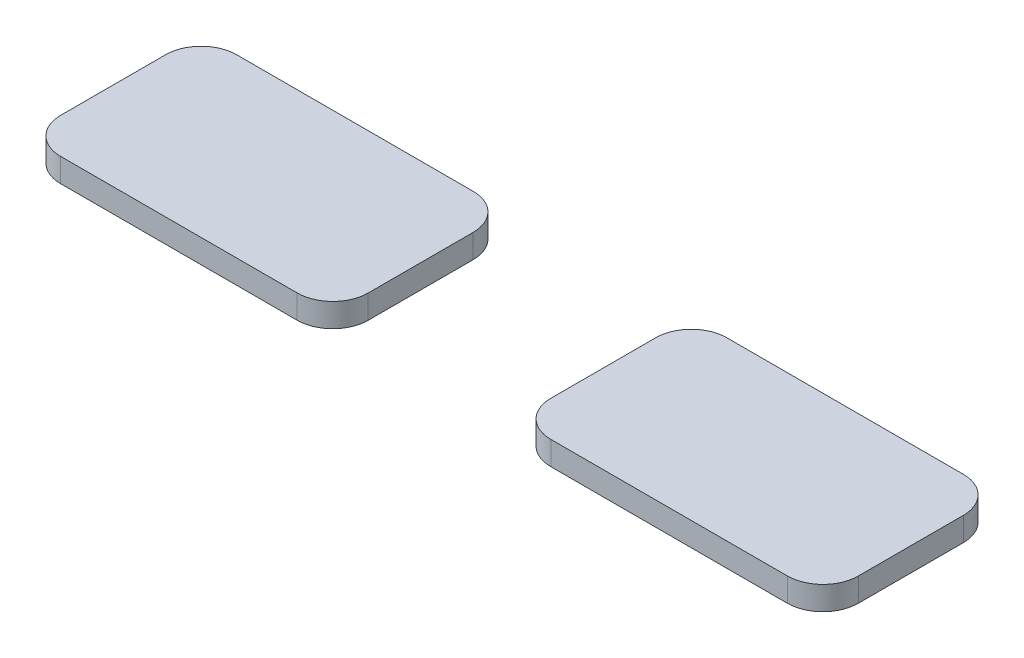
ISO-10303-21;
HEADER;
FILE_DESCRIPTION(('STEP AP214'),'2;1');
FILE_NAME('part.step','',(''),(''),'','','');
FILE_SCHEMA(('AUTOMOTIVE_DESIGN { 1 0 10303 214 1 1 1 1 }'));
ENDSEC;
DATA;
#1=APPLICATION_CONTEXT('core data for automotive mechanical design processes');
#2=APPLICATION_PROTOCOL_DEFINITION('international standard','automotive_design',2000,#1);
#3=PRODUCT_CONTEXT('',#1,'mechanical');
#4=PRODUCT('Part','Part','',(#3));
#5=PRODUCT_RELATED_PRODUCT_CATEGORY('part','',(#4));
#6=PRODUCT_DEFINITION_FORMATION('','',#4);
#7=PRODUCT_DEFINITION_CONTEXT('part definition',#1,'design');
#8=PRODUCT_DEFINITION('design','',#6,#7);
#9=PRODUCT_DEFINITION_SHAPE('','',#8);
#10=(LENGTH_UNIT() NAMED_UNIT(*) SI_UNIT(.MILLI.,.METRE.));
#11=(NAMED_UNIT(*) PLANE_ANGLE_UNIT() SI_UNIT($,.RADIAN.));
#12=(NAMED_UNIT(*) SI_UNIT($,.STERADIAN.) SOLID_ANGLE_UNIT());
#13=UNCERTAINTY_MEASURE_WITH_UNIT(LENGTH_MEASURE(1.E-05),#10,'distance_accuracy_value','');
#14=(GEOMETRIC_REPRESENTATION_CONTEXT(3) GLOBAL_UNCERTAINTY_ASSIGNED_CONTEXT((#13)) GLOBAL_UNIT_ASSIGNED_CONTEXT((#10,
#11,#12)) REPRESENTATION_CONTEXT('',''));
#15=CARTESIAN_POINT('',(0.,0.,0.));
#16=DIRECTION('',(0.,0.,1.));
#17=DIRECTION('',(1.,0.,0.));
#18=AXIS2_PLACEMENT_3D('',#15,#16,#17);
#19=CARTESIAN_POINT('',(31.4146552937155,2.,-4.435));
#20=DIRECTION('',(0.,-1.,0.));
#21=DIRECTION('',(0.,0.,-1.));
#22=AXIS2_PLACEMENT_3D('',#19,#20,#21);
#23=CYLINDRICAL_SURFACE('',#22,3.);
#24=CARTESIAN_POINT('',(31.4146552937155,0.,-4.435));
#25=DIRECTION('',(0.,1.,0.));
#26=DIRECTION('',(0.,0.,1.));
#27=AXIS2_PLACEMENT_3D('',#24,#25,#26);
#28=CIRCLE('',#27,3.);
#29=CARTESIAN_POINT('',(31.4146552937156,0.,-7.435));
#30=VERTEX_POINT('',#29);
#31=CARTESIAN_POINT('',(28.4146552937155,0.,-4.43499999999998));
#32=VERTEX_POINT('',#31);
#33=EDGE_CURVE('E12',#30,#32,#28,.T.);
#34=ORIENTED_EDGE('',*,*,#33,.T.);
#35=DIRECTION('',(0.,-1.,0.));
#36=VECTOR('',#35,1.);
#37=CARTESIAN_POINT('',(28.4146552937155,2.,-4.43499999999998));
#38=LINE('',#37,#36);
#39=CARTESIAN_POINT('',(28.4146552937155,2.,-4.43499999999998));
#40=VERTEX_POINT('',#39);
#41=EDGE_CURVE('E187',#40,#32,#38,.T.);
#42=ORIENTED_EDGE('',*,*,#41,.F.);
#43=CARTESIAN_POINT('',(31.4146552937155,2.,-4.435));
#44=DIRECTION('',(0.,1.,0.));
#45=DIRECTION('',(0.,0.,1.));
#46=AXIS2_PLACEMENT_3D('',#43,#44,#45);
#47=CIRCLE('',#46,3.);
#48=CARTESIAN_POINT('',(31.4146552937156,2.,-7.435));
#49=VERTEX_POINT('',#48);
#50=EDGE_CURVE('E55',#49,#40,#47,.T.);
#51=ORIENTED_EDGE('',*,*,#50,.F.);
#52=DIRECTION('',(0.,-1.,0.));
#53=VECTOR('',#52,1.);
#54=CARTESIAN_POINT('',(31.4146552937156,2.,-7.435));
#55=LINE('',#54,#53);
#56=EDGE_CURVE('E155',#49,#30,#55,.T.);
#57=ORIENTED_EDGE('',*,*,#56,.T.);
#58=EDGE_LOOP('',(#34,#42,#51,#57));
#59=FACE_BOUND('',#58,.T.);
#60=ADVANCED_FACE('F51',(#59),#23,.T.);
#61=CARTESIAN_POINT('',(28.4146552937155,2.,4.43499999999998));
#62=DIRECTION('',(1.,0.,0.));
#63=DIRECTION('',(0.,0.,-1.));
#64=AXIS2_PLACEMENT_3D('',#61,#62,#63);
#65=PLANE('',#64);
#66=DIRECTION('',(0.,0.,1.));
#67=VECTOR('',#66,1.);
#68=CARTESIAN_POINT('',(28.4146552937155,0.,4.43499999999998));
#69=LINE('',#68,#67);
#70=CARTESIAN_POINT('',(28.4146552937155,0.,4.43499999999998));
#71=VERTEX_POINT('',#70);
#72=EDGE_CURVE('E61',#32,#71,#69,.T.);
#73=ORIENTED_EDGE('',*,*,#72,.T.);
#74=DIRECTION('',(0.,-1.,0.));
#75=VECTOR('',#74,1.);
#76=CARTESIAN_POINT('',(28.4146552937155,2.,4.43499999999998));
#77=LINE('',#76,#75);
#78=CARTESIAN_POINT('',(28.4146552937155,2.,4.43499999999998));
#79=VERTEX_POINT('',#78);
#80=EDGE_CURVE('E131',#79,#71,#77,.T.);
#81=ORIENTED_EDGE('',*,*,#80,.F.);
#82=DIRECTION('',(0.,0.,1.));
#83=VECTOR('',#82,1.);
#84=CARTESIAN_POINT('',(28.4146552937155,2.,4.43499999999998));
#85=LINE('',#84,#83);
#86=EDGE_CURVE('E97',#40,#79,#85,.T.);
#87=ORIENTED_EDGE('',*,*,#86,.F.);
#88=ORIENTED_EDGE('',*,*,#41,.T.);
#89=EDGE_LOOP('',(#73,#81,#87,#88));
#90=FACE_BOUND('',#89,.T.);
#91=ADVANCED_FACE('F193',(#90),#65,.F.);
#92=CARTESIAN_POINT('',(31.4146552937155,2.,4.435));
#93=DIRECTION('',(0.,-1.,0.));
#94=DIRECTION('',(0.,0.,-1.));
#95=AXIS2_PLACEMENT_3D('',#92,#93,#94);
#96=CYLINDRICAL_SURFACE('',#95,3.);
#97=CARTESIAN_POINT('',(31.4146552937155,0.,4.435));
#98=DIRECTION('',(0.,1.,0.));
#99=DIRECTION('',(0.,0.,-1.));
#100=AXIS2_PLACEMENT_3D('',#97,#98,#99);
#101=CIRCLE('',#100,3.);
#102=CARTESIAN_POINT('',(31.4146552937156,0.,7.435));
#103=VERTEX_POINT('',#102);
#104=EDGE_CURVE('E125',#71,#103,#101,.T.);
#105=ORIENTED_EDGE('',*,*,#104,.T.);
#106=DIRECTION('',(0.,-1.,0.));
#107=VECTOR('',#106,1.);
#108=CARTESIAN_POINT('',(31.4146552937156,2.,7.435));
#109=LINE('',#108,#107);
#110=CARTESIAN_POINT('',(31.4146552937156,2.,7.435));
#111=VERTEX_POINT('',#110);
#112=EDGE_CURVE('E129',#111,#103,#109,.T.);
#113=ORIENTED_EDGE('',*,*,#112,.F.);
#114=CARTESIAN_POINT('',(31.4146552937155,2.,4.435));
#115=DIRECTION('',(0.,1.,0.));
#116=DIRECTION('',(0.,0.,-1.));
#117=AXIS2_PLACEMENT_3D('',#114,#115,#116);
#118=CIRCLE('',#117,3.);
#119=EDGE_CURVE('E162',#79,#111,#118,.T.);
#120=ORIENTED_EDGE('',*,*,#119,.F.);
#121=ORIENTED_EDGE('',*,*,#80,.T.);
#122=EDGE_LOOP('',(#105,#113,#120,#121));
#123=FACE_BOUND('',#122,.T.);
#124=ADVANCED_FACE('F127',(#123),#96,.T.);
#125=CARTESIAN_POINT('',(51.4046552937155,2.,7.435));
#126=DIRECTION('',(0.,0.,-1.));
#127=DIRECTION('',(-1.,0.,0.));
#128=AXIS2_PLACEMENT_3D('',#125,#126,#127);
#129=PLANE('',#128);
#130=DIRECTION('',(1.,0.,0.));
#131=VECTOR('',#130,1.);
#132=CARTESIAN_POINT('',(51.4046552937155,0.,7.435));
#133=LINE('',#132,#131);
#134=CARTESIAN_POINT('',(51.4046552937155,0.,7.435));
#135=VERTEX_POINT('',#134);
#136=EDGE_CURVE('E133',#103,#135,#133,.T.);
#137=ORIENTED_EDGE('',*,*,#136,.T.);
#138=DIRECTION('',(0.,-1.,0.));
#139=VECTOR('',#138,1.);
#140=CARTESIAN_POINT('',(51.4046552937155,2.,7.435));
#141=LINE('',#140,#139);
#142=CARTESIAN_POINT('',(51.4046552937155,2.,7.435));
#143=VERTEX_POINT('',#142);
#144=EDGE_CURVE('E140',#143,#135,#141,.T.);
#145=ORIENTED_EDGE('',*,*,#144,.F.);
#146=DIRECTION('',(1.,0.,0.));
#147=VECTOR('',#146,1.);
#148=CARTESIAN_POINT('',(51.4046552937155,2.,7.435));
#149=LINE('',#148,#147);
#150=EDGE_CURVE('E139',#111,#143,#149,.T.);
#151=ORIENTED_EDGE('',*,*,#150,.F.);
#152=ORIENTED_EDGE('',*,*,#112,.T.);
#153=EDGE_LOOP('',(#137,#145,#151,#152));
#154=FACE_BOUND('',#153,.T.);
#155=ADVANCED_FACE('F136',(#154),#129,.F.);
#156=CARTESIAN_POINT('',(51.4046552937155,2.,4.435));
#157=DIRECTION('',(0.,-1.,0.));
#158=DIRECTION('',(0.,0.,-1.));
#159=AXIS2_PLACEMENT_3D('',#156,#157,#158);
#160=CYLINDRICAL_SURFACE('',#159,3.);
#161=CARTESIAN_POINT('',(51.4046552937155,0.,4.435));
#162=DIRECTION('',(0.,1.,0.));
#163=DIRECTION('',(0.,0.,1.));
#164=AXIS2_PLACEMENT_3D('',#161,#162,#163);
#165=CIRCLE('',#164,3.);
#166=CARTESIAN_POINT('',(54.4046552937155,0.,4.43499999999998));
#167=VERTEX_POINT('',#166);
#168=EDGE_CURVE('E145',#135,#167,#165,.T.);
#169=ORIENTED_EDGE('',*,*,#168,.T.);
#170=DIRECTION('',(0.,-1.,0.));
#171=VECTOR('',#170,1.);
#172=CARTESIAN_POINT('',(54.4046552937155,2.,4.43499999999998));
#173=LINE('',#172,#171);
#174=CARTESIAN_POINT('',(54.4046552937155,2.,4.43499999999998));
#175=VERTEX_POINT('',#174);
#176=EDGE_CURVE('E179',#175,#167,#173,.T.);
#177=ORIENTED_EDGE('',*,*,#176,.F.);
#178=CARTESIAN_POINT('',(51.4046552937155,2.,4.435));
#179=DIRECTION('',(0.,1.,0.));
#180=DIRECTION('',(0.,0.,1.));
#181=AXIS2_PLACEMENT_3D('',#178,#179,#180);
#182=CIRCLE('',#181,3.);
#183=EDGE_CURVE('E159',#143,#175,#182,.T.);
#184=ORIENTED_EDGE('',*,*,#183,.F.);
#185=ORIENTED_EDGE('',*,*,#144,.T.);
#186=EDGE_LOOP('',(#169,#177,#184,#185));
#187=FACE_BOUND('',#186,.T.);
#188=ADVANCED_FACE('F196',(#187),#160,.T.);
#189=CARTESIAN_POINT('',(54.4046552937155,2.,4.43499999999998));
#190=DIRECTION('',(-1.,0.,0.));
#191=DIRECTION('',(0.,0.,1.));
#192=AXIS2_PLACEMENT_3D('',#189,#190,#191);
#193=PLANE('',#192);
#194=DIRECTION('',(0.,0.,-1.));
#195=VECTOR('',#194,1.);
#196=CARTESIAN_POINT('',(54.4046552937155,0.,4.43499999999998));
#197=LINE('',#196,#195);
#198=CARTESIAN_POINT('',(54.4046552937155,0.,-4.43499999999998));
#199=VERTEX_POINT('',#198);
#200=EDGE_CURVE('E147',#167,#199,#197,.T.);
#201=ORIENTED_EDGE('',*,*,#200,.T.);
#202=DIRECTION('',(0.,-1.,0.));
#203=VECTOR('',#202,1.);
#204=CARTESIAN_POINT('',(54.4046552937155,2.,-4.43499999999998));
#205=LINE('',#204,#203);
#206=CARTESIAN_POINT('',(54.4046552937155,2.,-4.43499999999998));
#207=VERTEX_POINT('',#206);
#208=EDGE_CURVE('E176',#207,#199,#205,.T.);
#209=ORIENTED_EDGE('',*,*,#208,.F.);
#210=DIRECTION('',(0.,0.,-1.));
#211=VECTOR('',#210,1.);
#212=CARTESIAN_POINT('',(54.4046552937155,2.,4.43499999999998));
#213=LINE('',#212,#211);
#214=EDGE_CURVE('E157',#175,#207,#213,.T.);
#215=ORIENTED_EDGE('',*,*,#214,.F.);
#216=ORIENTED_EDGE('',*,*,#176,.T.);
#217=EDGE_LOOP('',(#201,#209,#215,#216));
#218=FACE_BOUND('',#217,.T.);
#219=ADVANCED_FACE('F174',(#218),#193,.F.);
#220=CARTESIAN_POINT('',(51.4046552937155,2.,-4.435));
#221=DIRECTION('',(0.,-1.,0.));
#222=DIRECTION('',(0.,0.,-1.));
#223=AXIS2_PLACEMENT_3D('',#220,#221,#222);
#224=CYLINDRICAL_SURFACE('',#223,3.);
#225=CARTESIAN_POINT('',(51.4046552937155,0.,-4.435));
#226=DIRECTION('',(0.,1.,0.));
#227=DIRECTION('',(0.,0.,1.));
#228=AXIS2_PLACEMENT_3D('',#225,#226,#227);
#229=CIRCLE('',#228,3.);
#230=CARTESIAN_POINT('',(51.4046552937155,0.,-7.435));
#231=VERTEX_POINT('',#230);
#232=EDGE_CURVE('E165',#199,#231,#229,.T.);
#233=ORIENTED_EDGE('',*,*,#232,.T.);
#234=DIRECTION('',(0.,-1.,0.));
#235=VECTOR('',#234,1.);
#236=CARTESIAN_POINT('',(51.4046552937155,2.,-7.435));
#237=LINE('',#236,#235);
#238=CARTESIAN_POINT('',(51.4046552937155,2.,-7.435));
#239=VERTEX_POINT('',#238);
#240=EDGE_CURVE('E184',#239,#231,#237,.T.);
#241=ORIENTED_EDGE('',*,*,#240,.F.);
#242=CARTESIAN_POINT('',(51.4046552937155,2.,-4.435));
#243=DIRECTION('',(0.,1.,0.));
#244=DIRECTION('',(0.,0.,1.));
#245=AXIS2_PLACEMENT_3D('',#242,#243,#244);
#246=CIRCLE('',#245,3.);
#247=EDGE_CURVE('E154',#207,#239,#246,.T.);
#248=ORIENTED_EDGE('',*,*,#247,.F.);
#249=ORIENTED_EDGE('',*,*,#208,.T.);
#250=EDGE_LOOP('',(#233,#241,#248,#249));
#251=FACE_BOUND('',#250,.T.);
#252=ADVANCED_FACE('F182',(#251),#224,.T.);
#253=CARTESIAN_POINT('',(51.4046552937155,2.,-7.435));
#254=DIRECTION('',(0.,0.,1.));
#255=DIRECTION('',(1.,0.,0.));
#256=AXIS2_PLACEMENT_3D('',#253,#254,#255);
#257=PLANE('',#256);
#258=DIRECTION('',(-1.,0.,0.));
#259=VECTOR('',#258,1.);
#260=CARTESIAN_POINT('',(51.4046552937155,0.,-7.435));
#261=LINE('',#260,#259);
#262=EDGE_CURVE('E108',#231,#30,#261,.T.);
#263=ORIENTED_EDGE('',*,*,#262,.T.);
#264=ORIENTED_EDGE('',*,*,#56,.F.);
#265=DIRECTION('',(-1.,0.,0.));
#266=VECTOR('',#265,1.);
#267=CARTESIAN_POINT('',(51.4046552937155,2.,-7.435));
#268=LINE('',#267,#266);
#269=EDGE_CURVE('E152',#239,#49,#268,.T.);
#270=ORIENTED_EDGE('',*,*,#269,.F.);
#271=ORIENTED_EDGE('',*,*,#240,.T.);
#272=EDGE_LOOP('',(#263,#264,#270,#271));
#273=FACE_BOUND('',#272,.T.);
#274=ADVANCED_FACE('F197',(#273),#257,.F.);
#275=CARTESIAN_POINT('',(31.4146552937155,2.,-4.435));
#276=DIRECTION('',(0.,1.,0.));
#277=DIRECTION('',(0.,0.,1.));
#278=AXIS2_PLACEMENT_3D('',#275,#276,#277);
#279=PLANE('',#278);
#280=ORIENTED_EDGE('',*,*,#50,.T.);
#281=ORIENTED_EDGE('',*,*,#86,.T.);
#282=ORIENTED_EDGE('',*,*,#119,.T.);
#283=ORIENTED_EDGE('',*,*,#150,.T.);
#284=ORIENTED_EDGE('',*,*,#183,.T.);
#285=ORIENTED_EDGE('',*,*,#214,.T.);
#286=ORIENTED_EDGE('',*,*,#247,.T.);
#287=ORIENTED_EDGE('',*,*,#269,.T.);
#288=EDGE_LOOP('',(#280,#281,#282,#283,#284,#285,#286,#287));
#289=FACE_BOUND('',#288,.T.);
#290=ADVANCED_FACE('F53',(#289),#279,.T.);
#291=CARTESIAN_POINT('',(31.4146552937155,0.,-4.435));
#292=DIRECTION('',(0.,1.,0.));
#293=DIRECTION('',(0.,0.,1.));
#294=AXIS2_PLACEMENT_3D('',#291,#292,#293);
#295=PLANE('',#294);
#296=ORIENTED_EDGE('',*,*,#33,.F.);
#297=ORIENTED_EDGE('',*,*,#262,.F.);
#298=ORIENTED_EDGE('',*,*,#232,.F.);
#299=ORIENTED_EDGE('',*,*,#200,.F.);
#300=ORIENTED_EDGE('',*,*,#168,.F.);
#301=ORIENTED_EDGE('',*,*,#136,.F.);
#302=ORIENTED_EDGE('',*,*,#104,.F.);
#303=ORIENTED_EDGE('',*,*,#72,.F.);
#304=EDGE_LOOP('',(#296,#297,#298,#299,#300,#301,#302,#303));
#305=FACE_BOUND('',#304,.T.);
#306=ADVANCED_FACE('F143',(#305),#295,.F.);
#307=CLOSED_SHELL('',(#60,#91,#124,#155,#188,#219,#252,#274,#290,#306));
#308=MANIFOLD_SOLID_BREP('B2',#307);
#309=CARTESIAN_POINT('',(9.995,2.,-4.435));
#310=DIRECTION('',(0.,-1.,0.));
#311=DIRECTION('',(0.,0.,-1.));
#312=AXIS2_PLACEMENT_3D('',#309,#310,#311);
#313=CYLINDRICAL_SURFACE('',#312,3.);
#314=CARTESIAN_POINT('',(9.995,0.,-4.435));
#315=DIRECTION('',(0.,1.,0.));
#316=DIRECTION('',(0.,0.,-1.));
#317=AXIS2_PLACEMENT_3D('',#314,#315,#316);
#318=CIRCLE('',#317,3.);
#319=CARTESIAN_POINT('',(12.995,0.,-4.43499999999998));
#320=VERTEX_POINT('',#319);
#321=CARTESIAN_POINT('',(9.99499999999998,0.,-7.435));
#322=VERTEX_POINT('',#321);
#323=EDGE_CURVE('E395',#320,#322,#318,.T.);
#324=ORIENTED_EDGE('',*,*,#323,.T.);
#325=DIRECTION('',(0.,-1.,0.));
#326=VECTOR('',#325,1.);
#327=CARTESIAN_POINT('',(9.99499999999998,2.,-7.435));
#328=LINE('',#327,#326);
#329=CARTESIAN_POINT('',(9.99499999999998,2.,-7.435));
#330=VERTEX_POINT('',#329);
#331=EDGE_CURVE('E49',#330,#322,#328,.T.);
#332=ORIENTED_EDGE('',*,*,#331,.F.);
#333=CARTESIAN_POINT('',(9.995,2.,-4.435));
#334=DIRECTION('',(0.,1.,0.));
#335=DIRECTION('',(0.,0.,-1.));
#336=AXIS2_PLACEMENT_3D('',#333,#334,#335);
#337=CIRCLE('',#336,3.);
#338=CARTESIAN_POINT('',(12.995,2.,-4.43499999999998));
#339=VERTEX_POINT('',#338);
#340=EDGE_CURVE('E409',#339,#330,#337,.T.);
#341=ORIENTED_EDGE('',*,*,#340,.F.);
#342=DIRECTION('',(0.,-1.,0.));
#343=VECTOR('',#342,1.);
#344=CARTESIAN_POINT('',(12.995,2.,-4.43499999999998));
#345=LINE('',#344,#343);
#346=EDGE_CURVE('E391',#339,#320,#345,.T.);
#347=ORIENTED_EDGE('',*,*,#346,.T.);
#348=EDGE_LOOP('',(#324,#332,#341,#347));
#349=FACE_BOUND('',#348,.T.);
#350=ADVANCED_FACE('F299',(#349),#313,.T.);
#351=CARTESIAN_POINT('',(-9.99499999999998,2.,-7.435));
#352=DIRECTION('',(0.,0.,1.));
#353=DIRECTION('',(1.,0.,0.));
#354=AXIS2_PLACEMENT_3D('',#351,#352,#353);
#355=PLANE('',#354);
#356=DIRECTION('',(-1.,0.,0.));
#357=VECTOR('',#356,1.);
#358=CARTESIAN_POINT('',(-9.99499999999998,0.,-7.435));
#359=LINE('',#358,#357);
#360=CARTESIAN_POINT('',(-9.99499999999998,0.,-7.435));
#361=VERTEX_POINT('',#360);
#362=EDGE_CURVE('E398',#322,#361,#359,.T.);
#363=ORIENTED_EDGE('',*,*,#362,.T.);
#364=DIRECTION('',(0.,-1.,0.));
#365=VECTOR('',#364,1.);
#366=CARTESIAN_POINT('',(-9.99499999999998,2.,-7.435));
#367=LINE('',#366,#365);
#368=CARTESIAN_POINT('',(-9.99499999999998,2.,-7.435));
#369=VERTEX_POINT('',#368);
#370=EDGE_CURVE('E307',#369,#361,#367,.T.);
#371=ORIENTED_EDGE('',*,*,#370,.F.);
#372=DIRECTION('',(-1.,0.,0.));
#373=VECTOR('',#372,1.);
#374=CARTESIAN_POINT('',(-9.99499999999998,2.,-7.435));
#375=LINE('',#374,#373);
#376=EDGE_CURVE('E358',#330,#369,#375,.T.);
#377=ORIENTED_EDGE('',*,*,#376,.F.);
#378=ORIENTED_EDGE('',*,*,#331,.T.);
#379=EDGE_LOOP('',(#363,#371,#377,#378));
#380=FACE_BOUND('',#379,.T.);
#381=ADVANCED_FACE('F444',(#380),#355,.F.);
#382=CARTESIAN_POINT('',(-9.995,2.,-4.435));
#383=DIRECTION('',(0.,-1.,0.));
#384=DIRECTION('',(0.,0.,-1.));
#385=AXIS2_PLACEMENT_3D('',#382,#383,#384);
#386=CYLINDRICAL_SURFACE('',#385,3.);
#387=CARTESIAN_POINT('',(-9.995,0.,-4.435));
#388=DIRECTION('',(0.,1.,0.));
#389=DIRECTION('',(0.,0.,-1.));
#390=AXIS2_PLACEMENT_3D('',#387,#388,#389);
#391=CIRCLE('',#390,3.);
#392=CARTESIAN_POINT('',(-12.995,0.,-4.43499999999998));
#393=VERTEX_POINT('',#392);
#394=EDGE_CURVE('E400',#361,#393,#391,.T.);
#395=ORIENTED_EDGE('',*,*,#394,.T.);
#396=DIRECTION('',(0.,-1.,0.));
#397=VECTOR('',#396,1.);
#398=CARTESIAN_POINT('',(-12.995,2.,-4.43499999999998));
#399=LINE('',#398,#397);
#400=CARTESIAN_POINT('',(-12.995,2.,-4.43499999999998));
#401=VERTEX_POINT('',#400);
#402=EDGE_CURVE('E416',#401,#393,#399,.T.);
#403=ORIENTED_EDGE('',*,*,#402,.F.);
#404=CARTESIAN_POINT('',(-9.995,2.,-4.435));
#405=DIRECTION('',(0.,1.,0.));
#406=DIRECTION('',(0.,0.,-1.));
#407=AXIS2_PLACEMENT_3D('',#404,#405,#406);
#408=CIRCLE('',#407,3.);
#409=EDGE_CURVE('E424',#369,#401,#408,.T.);
#410=ORIENTED_EDGE('',*,*,#409,.F.);
#411=ORIENTED_EDGE('',*,*,#370,.T.);
#412=EDGE_LOOP('',(#395,#403,#410,#411));
#413=FACE_BOUND('',#412,.T.);
#414=ADVANCED_FACE('F422',(#413),#386,.T.);
#415=CARTESIAN_POINT('',(-12.995,2.,4.43499999999998));
#416=DIRECTION('',(1.,0.,0.));
#417=DIRECTION('',(0.,0.,-1.));
#418=AXIS2_PLACEMENT_3D('',#415,#416,#417);
#419=PLANE('',#418);
#420=DIRECTION('',(0.,0.,1.));
#421=VECTOR('',#420,1.);
#422=CARTESIAN_POINT('',(-12.995,0.,4.43499999999998));
#423=LINE('',#422,#421);
#424=CARTESIAN_POINT('',(-12.995,0.,4.43499999999998));
#425=VERTEX_POINT('',#424);
#426=EDGE_CURVE('E402',#393,#425,#423,.T.);
#427=ORIENTED_EDGE('',*,*,#426,.T.);
#428=DIRECTION('',(0.,-1.,0.));
#429=VECTOR('',#428,1.);
#430=CARTESIAN_POINT('',(-12.995,2.,4.43499999999998));
#431=LINE('',#430,#429);
#432=CARTESIAN_POINT('',(-12.995,2.,4.43499999999998));
#433=VERTEX_POINT('',#432);
#434=EDGE_CURVE('E413',#433,#425,#431,.T.);
#435=ORIENTED_EDGE('',*,*,#434,.F.);
#436=DIRECTION('',(0.,0.,1.));
#437=VECTOR('',#436,1.);
#438=CARTESIAN_POINT('',(-12.995,2.,4.43499999999998));
#439=LINE('',#438,#437);
#440=EDGE_CURVE('E436',#401,#433,#439,.T.);
#441=ORIENTED_EDGE('',*,*,#440,.F.);
#442=ORIENTED_EDGE('',*,*,#402,.T.);
#443=EDGE_LOOP('',(#427,#435,#441,#442));
#444=FACE_BOUND('',#443,.T.);
#445=ADVANCED_FACE('F432',(#444),#419,.F.);
#446=CARTESIAN_POINT('',(-9.995,2.,4.435));
#447=DIRECTION('',(0.,-1.,0.));
#448=DIRECTION('',(0.,0.,-1.));
#449=AXIS2_PLACEMENT_3D('',#446,#447,#448);
#450=CYLINDRICAL_SURFACE('',#449,3.);
#451=CARTESIAN_POINT('',(-9.995,0.,4.435));
#452=DIRECTION('',(0.,1.,0.));
#453=DIRECTION('',(0.,0.,-1.));
#454=AXIS2_PLACEMENT_3D('',#451,#452,#453);
#455=CIRCLE('',#454,3.);
#456=CARTESIAN_POINT('',(-9.99499999999998,0.,7.435));
#457=VERTEX_POINT('',#456);
#458=EDGE_CURVE('E404',#425,#457,#455,.T.);
#459=ORIENTED_EDGE('',*,*,#458,.T.);
#460=DIRECTION('',(0.,-1.,0.));
#461=VECTOR('',#460,1.);
#462=CARTESIAN_POINT('',(-9.99499999999998,2.,7.435));
#463=LINE('',#462,#461);
#464=CARTESIAN_POINT('',(-9.99499999999998,2.,7.435));
#465=VERTEX_POINT('',#464);
#466=EDGE_CURVE('E386',#465,#457,#463,.T.);
#467=ORIENTED_EDGE('',*,*,#466,.F.);
#468=CARTESIAN_POINT('',(-9.995,2.,4.435));
#469=DIRECTION('',(0.,1.,0.));
#470=DIRECTION('',(0.,0.,-1.));
#471=AXIS2_PLACEMENT_3D('',#468,#469,#470);
#472=CIRCLE('',#471,3.);
#473=EDGE_CURVE('E377',#433,#465,#472,.T.);
#474=ORIENTED_EDGE('',*,*,#473,.F.);
#475=ORIENTED_EDGE('',*,*,#434,.T.);
#476=EDGE_LOOP('',(#459,#467,#474,#475));
#477=FACE_BOUND('',#476,.T.);
#478=ADVANCED_FACE('F435',(#477),#450,.T.);
#479=CARTESIAN_POINT('',(-9.99499999999998,2.,7.435));
#480=DIRECTION('',(0.,0.,-1.));
#481=DIRECTION('',(-1.,0.,0.));
#482=AXIS2_PLACEMENT_3D('',#479,#480,#481);
#483=PLANE('',#482);
#484=DIRECTION('',(1.,0.,0.));
#485=VECTOR('',#484,1.);
#486=CARTESIAN_POINT('',(-9.99499999999998,0.,7.435));
#487=LINE('',#486,#485);
#488=CARTESIAN_POINT('',(9.99499999999998,0.,7.435));
#489=VERTEX_POINT('',#488);
#490=EDGE_CURVE('E385',#457,#489,#487,.T.);
#491=ORIENTED_EDGE('',*,*,#490,.T.);
#492=DIRECTION('',(0.,-1.,0.));
#493=VECTOR('',#492,1.);
#494=CARTESIAN_POINT('',(9.99499999999998,2.,7.435));
#495=LINE('',#494,#493);
#496=CARTESIAN_POINT('',(9.99499999999998,2.,7.435));
#497=VERTEX_POINT('',#496);
#498=EDGE_CURVE('E382',#497,#489,#495,.T.);
#499=ORIENTED_EDGE('',*,*,#498,.F.);
#500=DIRECTION('',(1.,0.,0.));
#501=VECTOR('',#500,1.);
#502=CARTESIAN_POINT('',(-9.99499999999998,2.,7.435));
#503=LINE('',#502,#501);
#504=EDGE_CURVE('E371',#465,#497,#503,.T.);
#505=ORIENTED_EDGE('',*,*,#504,.F.);
#506=ORIENTED_EDGE('',*,*,#466,.T.);
#507=EDGE_LOOP('',(#491,#499,#505,#506));
#508=FACE_BOUND('',#507,.T.);
#509=ADVANCED_FACE('F383',(#508),#483,.F.);
#510=CARTESIAN_POINT('',(9.995,2.,4.435));
#511=DIRECTION('',(0.,-1.,0.));
#512=DIRECTION('',(0.,0.,-1.));
#513=AXIS2_PLACEMENT_3D('',#510,#511,#512);
#514=CYLINDRICAL_SURFACE('',#513,3.);
#515=CARTESIAN_POINT('',(9.995,0.,4.435));
#516=DIRECTION('',(0.,1.,0.));
#517=DIRECTION('',(0.,0.,1.));
#518=AXIS2_PLACEMENT_3D('',#515,#516,#517);
#519=CIRCLE('',#518,3.);
#520=CARTESIAN_POINT('',(12.995,0.,4.43499999999998));
#521=VERTEX_POINT('',#520);
#522=EDGE_CURVE('E344',#489,#521,#519,.T.);
#523=ORIENTED_EDGE('',*,*,#522,.T.);
#524=DIRECTION('',(0.,-1.,0.));
#525=VECTOR('',#524,1.);
#526=CARTESIAN_POINT('',(12.995,2.,4.43499999999998));
#527=LINE('',#526,#525);
#528=CARTESIAN_POINT('',(12.995,2.,4.43499999999998));
#529=VERTEX_POINT('',#528);
#530=EDGE_CURVE('E387',#529,#521,#527,.T.);
#531=ORIENTED_EDGE('',*,*,#530,.F.);
#532=CARTESIAN_POINT('',(9.995,2.,4.435));
#533=DIRECTION('',(0.,1.,0.));
#534=DIRECTION('',(0.,0.,1.));
#535=AXIS2_PLACEMENT_3D('',#532,#533,#534);
#536=CIRCLE('',#535,3.);
#537=EDGE_CURVE('E375',#497,#529,#536,.T.);
#538=ORIENTED_EDGE('',*,*,#537,.F.);
#539=ORIENTED_EDGE('',*,*,#498,.T.);
#540=EDGE_LOOP('',(#523,#531,#538,#539));
#541=FACE_BOUND('',#540,.T.);
#542=ADVANCED_FACE('F389',(#541),#514,.T.);
#543=CARTESIAN_POINT('',(12.995,2.,4.43499999999998));
#544=DIRECTION('',(-1.,0.,0.));
#545=DIRECTION('',(0.,0.,1.));
#546=AXIS2_PLACEMENT_3D('',#543,#544,#545);
#547=PLANE('',#546);
#548=DIRECTION('',(0.,0.,-1.));
#549=VECTOR('',#548,1.);
#550=CARTESIAN_POINT('',(12.995,0.,4.43499999999998));
#551=LINE('',#550,#549);
#552=EDGE_CURVE('E350',#521,#320,#551,.T.);
#553=ORIENTED_EDGE('',*,*,#552,.T.);
#554=ORIENTED_EDGE('',*,*,#346,.F.);
#555=DIRECTION('',(0.,0.,-1.));
#556=VECTOR('',#555,1.);
#557=CARTESIAN_POINT('',(12.995,2.,4.43499999999998));
#558=LINE('',#557,#556);
#559=EDGE_CURVE('E315',#529,#339,#558,.T.);
#560=ORIENTED_EDGE('',*,*,#559,.F.);
#561=ORIENTED_EDGE('',*,*,#530,.T.);
#562=EDGE_LOOP('',(#553,#554,#560,#561));
#563=FACE_BOUND('',#562,.T.);
#564=ADVANCED_FACE('F460',(#563),#547,.F.);
#565=CARTESIAN_POINT('',(9.995,2.,-4.435));
#566=DIRECTION('',(0.,-1.,0.));
#567=DIRECTION('',(0.,0.,-1.));
#568=AXIS2_PLACEMENT_3D('',#565,#566,#567);
#569=PLANE('',#568);
#570=ORIENTED_EDGE('',*,*,#340,.T.);
#571=ORIENTED_EDGE('',*,*,#376,.T.);
#572=ORIENTED_EDGE('',*,*,#409,.T.);
#573=ORIENTED_EDGE('',*,*,#440,.T.);
#574=ORIENTED_EDGE('',*,*,#473,.T.);
#575=ORIENTED_EDGE('',*,*,#504,.T.);
#576=ORIENTED_EDGE('',*,*,#537,.T.);
#577=ORIENTED_EDGE('',*,*,#559,.T.);
#578=EDGE_LOOP('',(#570,#571,#572,#573,#574,#575,#576,#577));
#579=FACE_BOUND('',#578,.T.);
#580=ADVANCED_FACE('F373',(#579),#569,.F.);
#581=CARTESIAN_POINT('',(9.995,0.,-4.435));
#582=DIRECTION('',(0.,-1.,0.));
#583=DIRECTION('',(0.,0.,-1.));
#584=AXIS2_PLACEMENT_3D('',#581,#582,#583);
#585=PLANE('',#584);
#586=ORIENTED_EDGE('',*,*,#323,.F.);
#587=ORIENTED_EDGE('',*,*,#552,.F.);
#588=ORIENTED_EDGE('',*,*,#522,.F.);
#589=ORIENTED_EDGE('',*,*,#490,.F.);
#590=ORIENTED_EDGE('',*,*,#458,.F.);
#591=ORIENTED_EDGE('',*,*,#426,.F.);
#592=ORIENTED_EDGE('',*,*,#394,.F.);
#593=ORIENTED_EDGE('',*,*,#362,.F.);
#594=EDGE_LOOP('',(#586,#587,#588,#589,#590,#591,#592,#593));
#595=FACE_BOUND('',#594,.T.);
#596=ADVANCED_FACE('F428',(#595),#585,.T.);
#597=CLOSED_SHELL('',(#350,#381,#414,#445,#478,#509,#542,#564,#580,#596));
#598=MANIFOLD_SOLID_BREP('B6',#597);
#599=ADVANCED_BREP_SHAPE_REPRESENTATION('',(#18,#308,#598),#14);
#600=SHAPE_DEFINITION_REPRESENTATION(#9,#599);
ENDSEC;
END-ISO-10303-21;
